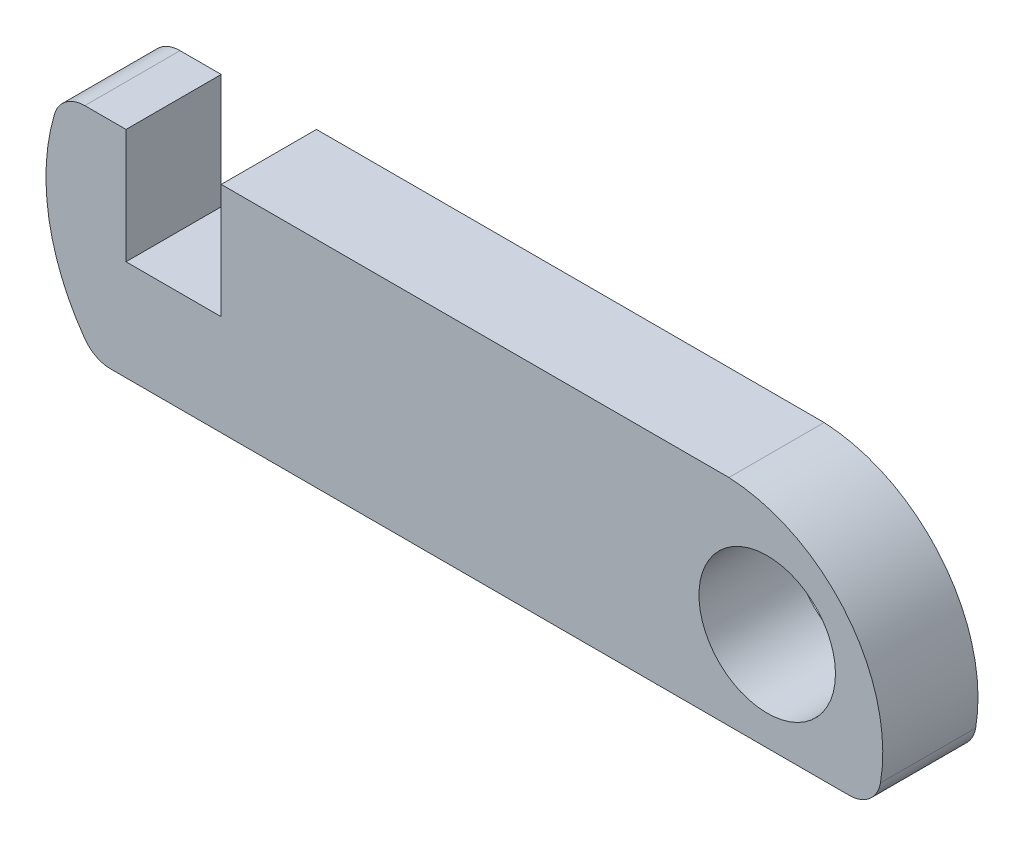
ISO-10303-21;
HEADER;
FILE_DESCRIPTION(('STEP AP214'),'2;1');
FILE_NAME('part.step','',(''),(''),'','','');
FILE_SCHEMA(('AUTOMOTIVE_DESIGN { 1 0 10303 214 1 1 1 1 }'));
ENDSEC;
DATA;
#1=APPLICATION_CONTEXT('core data for automotive mechanical design processes');
#2=APPLICATION_PROTOCOL_DEFINITION('international standard','automotive_design',2000,#1);
#3=PRODUCT_CONTEXT('',#1,'mechanical');
#4=PRODUCT('Part','Part','',(#3));
#5=PRODUCT_RELATED_PRODUCT_CATEGORY('part','',(#4));
#6=PRODUCT_DEFINITION_FORMATION('','',#4);
#7=PRODUCT_DEFINITION_CONTEXT('part definition',#1,'design');
#8=PRODUCT_DEFINITION('design','',#6,#7);
#9=PRODUCT_DEFINITION_SHAPE('','',#8);
#10=(LENGTH_UNIT() NAMED_UNIT(*) SI_UNIT(.MILLI.,.METRE.));
#11=(NAMED_UNIT(*) PLANE_ANGLE_UNIT() SI_UNIT($,.RADIAN.));
#12=(NAMED_UNIT(*) SI_UNIT($,.STERADIAN.) SOLID_ANGLE_UNIT());
#13=UNCERTAINTY_MEASURE_WITH_UNIT(LENGTH_MEASURE(1.E-05),#10,'distance_accuracy_value','');
#14=(GEOMETRIC_REPRESENTATION_CONTEXT(3) GLOBAL_UNCERTAINTY_ASSIGNED_CONTEXT((#13)) GLOBAL_UNIT_ASSIGNED_CONTEXT((#10,
#11,#12)) REPRESENTATION_CONTEXT('',''));
#15=CARTESIAN_POINT('',(0.,0.,0.));
#16=DIRECTION('',(0.,0.,1.));
#17=DIRECTION('',(1.,0.,0.));
#18=AXIS2_PLACEMENT_3D('',#15,#16,#17);
#19=CARTESIAN_POINT('',(24.7815778255979,-5.77777777777778,3.));
#20=DIRECTION('',(0.,0.,-1.));
#21=DIRECTION('',(-1.,0.,0.));
#22=AXIS2_PLACEMENT_3D('',#19,#20,#21);
#23=CYLINDRICAL_SURFACE('',#22,1.);
#24=CARTESIAN_POINT('',(24.7815778255979,-5.77777777777778,0.));
#25=DIRECTION('',(0.,0.,1.));
#26=DIRECTION('',(1.,0.,0.));
#27=AXIS2_PLACEMENT_3D('',#24,#25,#26);
#28=CIRCLE('',#27,1.);
#29=CARTESIAN_POINT('',(25.7671577611333,-5.94698826997632,0.));
#30=VERTEX_POINT('',#29);
#31=CARTESIAN_POINT('',(24.7815778255979,-6.77777777777778,0.));
#32=VERTEX_POINT('',#31);
#33=EDGE_CURVE('E151',#30,#32,#28,.F.);
#34=ORIENTED_EDGE('',*,*,#33,.F.);
#35=DIRECTION('',(0.,0.,-1.));
#36=VECTOR('',#35,1.);
#37=CARTESIAN_POINT('',(25.7671577611333,-5.94698826997632,3.));
#38=LINE('',#37,#36);
#39=CARTESIAN_POINT('',(25.7671577611333,-5.94698826997632,3.));
#40=VERTEX_POINT('',#39);
#41=EDGE_CURVE('E11',#40,#30,#38,.T.);
#42=ORIENTED_EDGE('',*,*,#41,.F.);
#43=CARTESIAN_POINT('',(24.7815778255979,-5.77777777777778,3.));
#44=DIRECTION('',(0.,0.,1.));
#45=DIRECTION('',(1.,0.,0.));
#46=AXIS2_PLACEMENT_3D('',#43,#44,#45);
#47=CIRCLE('',#46,1.);
#48=CARTESIAN_POINT('',(24.7815778255979,-6.77777777777778,3.));
#49=VERTEX_POINT('',#48);
#50=EDGE_CURVE('E182',#40,#49,#47,.F.);
#51=ORIENTED_EDGE('',*,*,#50,.T.);
#52=DIRECTION('',(0.,0.,-1.));
#53=VECTOR('',#52,1.);
#54=CARTESIAN_POINT('',(24.7815778255979,-6.77777777777778,3.));
#55=LINE('',#54,#53);
#56=EDGE_CURVE('E94',#49,#32,#55,.T.);
#57=ORIENTED_EDGE('',*,*,#56,.T.);
#58=EDGE_LOOP('',(#34,#42,#51,#57));
#59=FACE_BOUND('',#58,.T.);
#60=ADVANCED_FACE('F35',(#59),#23,.T.);
#61=CARTESIAN_POINT('',(20.7492357209889,-5.08548020998779,3.));
#62=DIRECTION('',(0.,0.,-1.));
#63=DIRECTION('',(-1.,0.,0.));
#64=AXIS2_PLACEMENT_3D('',#61,#62,#63);
#65=CYLINDRICAL_SURFACE('',#64,5.09133948371073);
#66=CARTESIAN_POINT('',(20.7492357209889,-5.08548020998779,0.));
#67=DIRECTION('',(0.,0.,1.));
#68=DIRECTION('',(1.,0.,0.));
#69=AXIS2_PLACEMENT_3D('',#66,#67,#68);
#70=CIRCLE('',#69,5.09133948371073);
#71=CARTESIAN_POINT('',(20.9934257539845,0.,0.));
#72=VERTEX_POINT('',#71);
#73=EDGE_CURVE('E154',#72,#30,#70,.F.);
#74=ORIENTED_EDGE('',*,*,#73,.F.);
#75=DIRECTION('',(0.,0.,-1.));
#76=VECTOR('',#75,1.);
#77=CARTESIAN_POINT('',(20.9934257539845,0.,3.));
#78=LINE('',#77,#76);
#79=CARTESIAN_POINT('',(20.9934257539845,0.,3.));
#80=VERTEX_POINT('',#79);
#81=EDGE_CURVE('E43',#80,#72,#78,.T.);
#82=ORIENTED_EDGE('',*,*,#81,.F.);
#83=CARTESIAN_POINT('',(20.7492357209889,-5.08548020998779,3.));
#84=DIRECTION('',(0.,0.,1.));
#85=DIRECTION('',(1.,0.,0.));
#86=AXIS2_PLACEMENT_3D('',#83,#84,#85);
#87=CIRCLE('',#86,5.09133948371073);
#88=EDGE_CURVE('E220',#80,#40,#87,.F.);
#89=ORIENTED_EDGE('',*,*,#88,.T.);
#90=ORIENTED_EDGE('',*,*,#41,.T.);
#91=EDGE_LOOP('',(#74,#82,#89,#90));
#92=FACE_BOUND('',#91,.T.);
#93=ADVANCED_FACE('F205',(#92),#65,.T.);
#94=CARTESIAN_POINT('',(0.,0.,3.));
#95=DIRECTION('',(0.,1.,0.));
#96=DIRECTION('',(0.,0.,1.));
#97=AXIS2_PLACEMENT_3D('',#94,#95,#96);
#98=PLANE('',#97);
#99=DIRECTION('',(1.,0.,0.));
#100=VECTOR('',#99,1.);
#101=CARTESIAN_POINT('',(0.,0.,0.));
#102=LINE('',#101,#100);
#103=CARTESIAN_POINT('',(5.,0.,0.));
#104=VERTEX_POINT('',#103);
#105=EDGE_CURVE('E157',#104,#72,#102,.T.);
#106=ORIENTED_EDGE('',*,*,#105,.F.);
#107=DIRECTION('',(0.,0.,-1.));
#108=VECTOR('',#107,1.);
#109=CARTESIAN_POINT('',(5.,0.,3.));
#110=LINE('',#109,#108);
#111=CARTESIAN_POINT('',(5.,0.,3.));
#112=VERTEX_POINT('',#111);
#113=EDGE_CURVE('E194',#112,#104,#110,.T.);
#114=ORIENTED_EDGE('',*,*,#113,.F.);
#115=DIRECTION('',(1.,0.,0.));
#116=VECTOR('',#115,1.);
#117=CARTESIAN_POINT('',(0.,0.,3.));
#118=LINE('',#117,#116);
#119=EDGE_CURVE('E201',#112,#80,#118,.T.);
#120=ORIENTED_EDGE('',*,*,#119,.T.);
#121=ORIENTED_EDGE('',*,*,#81,.T.);
#122=EDGE_LOOP('',(#106,#114,#120,#121));
#123=FACE_BOUND('',#122,.T.);
#124=ADVANCED_FACE('F199',(#123),#98,.T.);
#125=CARTESIAN_POINT('',(5.,0.,3.));
#126=DIRECTION('',(1.,0.,0.));
#127=DIRECTION('',(0.,0.,-1.));
#128=AXIS2_PLACEMENT_3D('',#125,#126,#127);
#129=PLANE('',#128);
#130=DIRECTION('',(0.,-1.,0.));
#131=VECTOR('',#130,1.);
#132=CARTESIAN_POINT('',(5.,0.,0.));
#133=LINE('',#132,#131);
#134=CARTESIAN_POINT('',(5.,-3.61111111111111,0.));
#135=VERTEX_POINT('',#134);
#136=EDGE_CURVE('E160',#104,#135,#133,.T.);
#137=ORIENTED_EDGE('',*,*,#136,.T.);
#138=DIRECTION('',(0.,0.,-1.));
#139=VECTOR('',#138,1.);
#140=CARTESIAN_POINT('',(5.,-3.61111111111111,3.));
#141=LINE('',#140,#139);
#142=CARTESIAN_POINT('',(5.,-3.61111111111111,3.));
#143=VERTEX_POINT('',#142);
#144=EDGE_CURVE('E192',#143,#135,#141,.T.);
#145=ORIENTED_EDGE('',*,*,#144,.F.);
#146=DIRECTION('',(0.,-1.,0.));
#147=VECTOR('',#146,1.);
#148=CARTESIAN_POINT('',(5.,0.,3.));
#149=LINE('',#148,#147);
#150=EDGE_CURVE('E216',#112,#143,#149,.T.);
#151=ORIENTED_EDGE('',*,*,#150,.F.);
#152=ORIENTED_EDGE('',*,*,#113,.T.);
#153=EDGE_LOOP('',(#137,#145,#151,#152));
#154=FACE_BOUND('',#153,.T.);
#155=ADVANCED_FACE('F213',(#154),#129,.F.);
#156=CARTESIAN_POINT('',(0.,-3.61111111111111,3.));
#157=DIRECTION('',(0.,1.,0.));
#158=DIRECTION('',(-1.,0.,0.));
#159=AXIS2_PLACEMENT_3D('',#156,#157,#158);
#160=PLANE('',#159);
#161=DIRECTION('',(1.,0.,0.));
#162=VECTOR('',#161,1.);
#163=CARTESIAN_POINT('',(0.,-3.61111111111111,0.));
#164=LINE('',#163,#162);
#165=CARTESIAN_POINT('',(2.,-3.61111111111111,0.));
#166=VERTEX_POINT('',#165);
#167=EDGE_CURVE('E163',#166,#135,#164,.T.);
#168=ORIENTED_EDGE('',*,*,#167,.F.);
#169=DIRECTION('',(0.,0.,-1.));
#170=VECTOR('',#169,1.);
#171=CARTESIAN_POINT('',(2.,-3.61111111111111,3.));
#172=LINE('',#171,#170);
#173=CARTESIAN_POINT('',(2.,-3.61111111111111,3.));
#174=VERTEX_POINT('',#173);
#175=EDGE_CURVE('E190',#174,#166,#172,.T.);
#176=ORIENTED_EDGE('',*,*,#175,.F.);
#177=DIRECTION('',(1.,0.,0.));
#178=VECTOR('',#177,1.);
#179=CARTESIAN_POINT('',(0.,-3.61111111111111,3.));
#180=LINE('',#179,#178);
#181=EDGE_CURVE('E218',#174,#143,#180,.T.);
#182=ORIENTED_EDGE('',*,*,#181,.T.);
#183=ORIENTED_EDGE('',*,*,#144,.T.);
#184=EDGE_LOOP('',(#168,#176,#182,#183));
#185=FACE_BOUND('',#184,.T.);
#186=ADVANCED_FACE('F320',(#185),#160,.T.);
#187=CARTESIAN_POINT('',(2.,0.,3.));
#188=DIRECTION('',(1.,0.,0.));
#189=DIRECTION('',(0.,1.,0.));
#190=AXIS2_PLACEMENT_3D('',#187,#188,#189);
#191=PLANE('',#190);
#192=DIRECTION('',(0.,-1.,0.));
#193=VECTOR('',#192,1.);
#194=CARTESIAN_POINT('',(2.,0.,0.));
#195=LINE('',#194,#193);
#196=CARTESIAN_POINT('',(2.,0.,0.));
#197=VERTEX_POINT('',#196);
#198=EDGE_CURVE('E166',#197,#166,#195,.T.);
#199=ORIENTED_EDGE('',*,*,#198,.F.);
#200=DIRECTION('',(0.,0.,-1.));
#201=VECTOR('',#200,1.);
#202=CARTESIAN_POINT('',(2.,0.,3.));
#203=LINE('',#202,#201);
#204=CARTESIAN_POINT('',(2.,0.,3.));
#205=VERTEX_POINT('',#204);
#206=EDGE_CURVE('E188',#205,#197,#203,.T.);
#207=ORIENTED_EDGE('',*,*,#206,.F.);
#208=DIRECTION('',(0.,-1.,0.));
#209=VECTOR('',#208,1.);
#210=CARTESIAN_POINT('',(2.,0.,3.));
#211=LINE('',#210,#209);
#212=EDGE_CURVE('E226',#205,#174,#211,.T.);
#213=ORIENTED_EDGE('',*,*,#212,.T.);
#214=ORIENTED_EDGE('',*,*,#175,.T.);
#215=EDGE_LOOP('',(#199,#207,#213,#214));
#216=FACE_BOUND('',#215,.T.);
#217=ADVANCED_FACE('F235',(#216),#191,.T.);
#218=CARTESIAN_POINT('',(0.,0.,3.));
#219=DIRECTION('',(0.,1.,0.));
#220=DIRECTION('',(0.,0.,1.));
#221=AXIS2_PLACEMENT_3D('',#218,#219,#220);
#222=PLANE('',#221);
#223=DIRECTION('',(1.,0.,0.));
#224=VECTOR('',#223,1.);
#225=CARTESIAN_POINT('',(0.,0.,0.));
#226=LINE('',#225,#224);
#227=CARTESIAN_POINT('',(0.702116043214498,0.,0.));
#228=VERTEX_POINT('',#227);
#229=EDGE_CURVE('E169',#228,#197,#226,.T.);
#230=ORIENTED_EDGE('',*,*,#229,.F.);
#231=DIRECTION('',(0.,0.,-1.));
#232=VECTOR('',#231,1.);
#233=CARTESIAN_POINT('',(0.702116043214498,0.,3.));
#234=LINE('',#233,#232);
#235=CARTESIAN_POINT('',(0.702116043214498,0.,3.));
#236=VERTEX_POINT('',#235);
#237=EDGE_CURVE('E186',#236,#228,#234,.T.);
#238=ORIENTED_EDGE('',*,*,#237,.F.);
#239=DIRECTION('',(1.,0.,0.));
#240=VECTOR('',#239,1.);
#241=CARTESIAN_POINT('',(0.,0.,3.));
#242=LINE('',#241,#240);
#243=EDGE_CURVE('E143',#236,#205,#242,.T.);
#244=ORIENTED_EDGE('',*,*,#243,.T.);
#245=ORIENTED_EDGE('',*,*,#206,.T.);
#246=EDGE_LOOP('',(#230,#238,#244,#245));
#247=FACE_BOUND('',#246,.T.);
#248=ADVANCED_FACE('F231',(#247),#222,.T.);
#249=CARTESIAN_POINT('',(0.702116043214498,-1.,3.));
#250=DIRECTION('',(0.,0.,-1.));
#251=DIRECTION('',(-1.,0.,0.));
#252=AXIS2_PLACEMENT_3D('',#249,#250,#251);
#253=CYLINDRICAL_SURFACE('',#252,1.);
#254=CARTESIAN_POINT('',(0.702116043214498,-1.,0.));
#255=DIRECTION('',(0.,0.,1.));
#256=DIRECTION('',(1.,0.,0.));
#257=AXIS2_PLACEMENT_3D('',#254,#255,#256);
#258=CIRCLE('',#257,1.);
#259=CARTESIAN_POINT('',(-0.257384218573151,-0.718292265584643,0.));
#260=VERTEX_POINT('',#259);
#261=EDGE_CURVE('E172',#228,#260,#258,.T.);
#262=ORIENTED_EDGE('',*,*,#261,.T.);
#263=DIRECTION('',(0.,0.,-1.));
#264=VECTOR('',#263,1.);
#265=CARTESIAN_POINT('',(-0.257384218573151,-0.718292265584643,3.));
#266=LINE('',#265,#264);
#267=CARTESIAN_POINT('',(-0.257384218573151,-0.718292265584643,3.));
#268=VERTEX_POINT('',#267);
#269=EDGE_CURVE('E130',#268,#260,#266,.T.);
#270=ORIENTED_EDGE('',*,*,#269,.F.);
#271=CARTESIAN_POINT('',(0.702116043214498,-1.,3.));
#272=DIRECTION('',(0.,0.,1.));
#273=DIRECTION('',(1.,0.,0.));
#274=AXIS2_PLACEMENT_3D('',#271,#272,#273);
#275=CIRCLE('',#274,1.);
#276=EDGE_CURVE('E140',#236,#268,#275,.T.);
#277=ORIENTED_EDGE('',*,*,#276,.F.);
#278=ORIENTED_EDGE('',*,*,#237,.T.);
#279=EDGE_LOOP('',(#262,#270,#277,#278));
#280=FACE_BOUND('',#279,.T.);
#281=ADVANCED_FACE('F238',(#280),#253,.T.);
#282=CARTESIAN_POINT('',(6.00343273768083,-2.55645805935896,3.));
#283=DIRECTION('',(0.,0.,-1.));
#284=DIRECTION('',(-1.,0.,0.));
#285=AXIS2_PLACEMENT_3D('',#282,#283,#284);
#286=CYLINDRICAL_SURFACE('',#285,6.52508102977422);
#287=CARTESIAN_POINT('',(6.00343273768083,-2.55645805935896,0.));
#288=DIRECTION('',(0.,0.,1.));
#289=DIRECTION('',(1.,0.,0.));
#290=AXIS2_PLACEMENT_3D('',#287,#288,#289);
#291=CIRCLE('',#290,6.52508102977422);
#292=CARTESIAN_POINT('',(0.702153460463403,-6.36081351988897,0.));
#293=VERTEX_POINT('',#292);
#294=EDGE_CURVE('E129',#293,#260,#291,.F.);
#295=ORIENTED_EDGE('',*,*,#294,.F.);
#296=DIRECTION('',(0.,0.,-1.));
#297=VECTOR('',#296,1.);
#298=CARTESIAN_POINT('',(0.702153460463403,-6.36081351988897,3.));
#299=LINE('',#298,#297);
#300=CARTESIAN_POINT('',(0.702153460463403,-6.36081351988897,3.));
#301=VERTEX_POINT('',#300);
#302=EDGE_CURVE('E123',#301,#293,#299,.T.);
#303=ORIENTED_EDGE('',*,*,#302,.F.);
#304=CARTESIAN_POINT('',(6.00343273768083,-2.55645805935896,3.));
#305=DIRECTION('',(0.,0.,1.));
#306=DIRECTION('',(1.,0.,0.));
#307=AXIS2_PLACEMENT_3D('',#304,#305,#306);
#308=CIRCLE('',#307,6.52508102977422);
#309=EDGE_CURVE('E127',#301,#268,#308,.F.);
#310=ORIENTED_EDGE('',*,*,#309,.T.);
#311=ORIENTED_EDGE('',*,*,#269,.T.);
#312=EDGE_LOOP('',(#295,#303,#310,#311));
#313=FACE_BOUND('',#312,.T.);
#314=ADVANCED_FACE('F125',(#313),#286,.T.);
#315=CARTESIAN_POINT('',(1.51459996542288,-5.77777777777778,3.));
#316=DIRECTION('',(0.,0.,-1.));
#317=DIRECTION('',(-1.,0.,0.));
#318=AXIS2_PLACEMENT_3D('',#315,#316,#317);
#319=CYLINDRICAL_SURFACE('',#318,1.);
#320=CARTESIAN_POINT('',(1.51459996542288,-5.77777777777778,0.));
#321=DIRECTION('',(0.,0.,1.));
#322=DIRECTION('',(1.,0.,0.));
#323=AXIS2_PLACEMENT_3D('',#320,#321,#322);
#324=CIRCLE('',#323,1.);
#325=CARTESIAN_POINT('',(1.51459996542288,-6.77777777777778,0.));
#326=VERTEX_POINT('',#325);
#327=EDGE_CURVE('E87',#293,#326,#324,.T.);
#328=ORIENTED_EDGE('',*,*,#327,.T.);
#329=DIRECTION('',(0.,0.,-1.));
#330=VECTOR('',#329,1.);
#331=CARTESIAN_POINT('',(1.51459996542288,-6.77777777777778,3.));
#332=LINE('',#331,#330);
#333=CARTESIAN_POINT('',(1.51459996542288,-6.77777777777778,3.));
#334=VERTEX_POINT('',#333);
#335=EDGE_CURVE('E131',#334,#326,#332,.T.);
#336=ORIENTED_EDGE('',*,*,#335,.F.);
#337=CARTESIAN_POINT('',(1.51459996542288,-5.77777777777778,3.));
#338=DIRECTION('',(0.,0.,1.));
#339=DIRECTION('',(1.,0.,0.));
#340=AXIS2_PLACEMENT_3D('',#337,#338,#339);
#341=CIRCLE('',#340,1.);
#342=EDGE_CURVE('E133',#301,#334,#341,.T.);
#343=ORIENTED_EDGE('',*,*,#342,.F.);
#344=ORIENTED_EDGE('',*,*,#302,.T.);
#345=EDGE_LOOP('',(#328,#336,#343,#344));
#346=FACE_BOUND('',#345,.T.);
#347=ADVANCED_FACE('F134',(#346),#319,.T.);
#348=CARTESIAN_POINT('',(0.,-6.77777777777778,3.));
#349=DIRECTION('',(0.,1.,0.));
#350=DIRECTION('',(-1.,0.,0.));
#351=AXIS2_PLACEMENT_3D('',#348,#349,#350);
#352=PLANE('',#351);
#353=DIRECTION('',(1.,0.,0.));
#354=VECTOR('',#353,1.);
#355=CARTESIAN_POINT('',(0.,-6.77777777777778,0.));
#356=LINE('',#355,#354);
#357=EDGE_CURVE('E177',#326,#32,#356,.T.);
#358=ORIENTED_EDGE('',*,*,#357,.T.);
#359=ORIENTED_EDGE('',*,*,#56,.F.);
#360=DIRECTION('',(1.,0.,0.));
#361=VECTOR('',#360,1.);
#362=CARTESIAN_POINT('',(0.,-6.77777777777778,3.));
#363=LINE('',#362,#361);
#364=EDGE_CURVE('E51',#334,#49,#363,.T.);
#365=ORIENTED_EDGE('',*,*,#364,.F.);
#366=ORIENTED_EDGE('',*,*,#335,.T.);
#367=EDGE_LOOP('',(#358,#359,#365,#366));
#368=FACE_BOUND('',#367,.T.);
#369=ADVANCED_FACE('F253',(#368),#352,.F.);
#370=CARTESIAN_POINT('',(22.2,-3.67777777777779,3.));
#371=DIRECTION('',(0.,0.,-1.));
#372=DIRECTION('',(-1.,0.,0.));
#373=AXIS2_PLACEMENT_3D('',#370,#371,#372);
#374=CYLINDRICAL_SURFACE('',#373,2.15);
#375=CARTESIAN_POINT('',(22.2,-3.67777777777779,3.));
#376=DIRECTION('',(0.,0.,1.));
#377=DIRECTION('',(1.,0.,0.));
#378=AXIS2_PLACEMENT_3D('',#375,#376,#377);
#379=CIRCLE('',#378,2.15);
#380=CARTESIAN_POINT('',(24.35,-3.67777777777779,3.));
#381=VERTEX_POINT('',#380);
#382=EDGE_CURVE('E148',#381,#381,#379,.T.);
#383=ORIENTED_EDGE('',*,*,#382,.T.);
#384=EDGE_LOOP('',(#383));
#385=FACE_BOUND('',#384,.T.);
#386=CARTESIAN_POINT('',(22.2,-3.67777777777779,0.));
#387=DIRECTION('',(0.,0.,1.));
#388=DIRECTION('',(1.,0.,0.));
#389=AXIS2_PLACEMENT_3D('',#386,#387,#388);
#390=CIRCLE('',#389,2.15);
#391=CARTESIAN_POINT('',(24.35,-3.67777777777779,0.));
#392=VERTEX_POINT('',#391);
#393=EDGE_CURVE('E179',#392,#392,#390,.T.);
#394=ORIENTED_EDGE('',*,*,#393,.F.);
#395=EDGE_LOOP('',(#394));
#396=FACE_BOUND('',#395,.T.);
#397=ADVANCED_FACE('F255',(#385,#396),#374,.F.);
#398=CARTESIAN_POINT('',(0.,0.,3.));
#399=DIRECTION('',(0.,0.,1.));
#400=DIRECTION('',(1.,0.,0.));
#401=AXIS2_PLACEMENT_3D('',#398,#399,#400);
#402=PLANE('',#401);
#403=ORIENTED_EDGE('',*,*,#50,.F.);
#404=ORIENTED_EDGE('',*,*,#88,.F.);
#405=ORIENTED_EDGE('',*,*,#119,.F.);
#406=ORIENTED_EDGE('',*,*,#150,.T.);
#407=ORIENTED_EDGE('',*,*,#181,.F.);
#408=ORIENTED_EDGE('',*,*,#212,.F.);
#409=ORIENTED_EDGE('',*,*,#243,.F.);
#410=ORIENTED_EDGE('',*,*,#276,.T.);
#411=ORIENTED_EDGE('',*,*,#309,.F.);
#412=ORIENTED_EDGE('',*,*,#342,.T.);
#413=ORIENTED_EDGE('',*,*,#364,.T.);
#414=EDGE_LOOP('',(#403,#404,#405,#406,#407,#408,#409,#410,#411,#412,#413));
#415=FACE_BOUND('',#414,.T.);
#416=ORIENTED_EDGE('',*,*,#382,.F.);
#417=EDGE_LOOP('',(#416));
#418=FACE_BOUND('',#417,.T.);
#419=ADVANCED_FACE('F136',(#415,#418),#402,.T.);
#420=CARTESIAN_POINT('',(0.,0.,0.));
#421=DIRECTION('',(0.,0.,1.));
#422=DIRECTION('',(1.,0.,0.));
#423=AXIS2_PLACEMENT_3D('',#420,#421,#422);
#424=PLANE('',#423);
#425=ORIENTED_EDGE('',*,*,#33,.T.);
#426=ORIENTED_EDGE('',*,*,#357,.F.);
#427=ORIENTED_EDGE('',*,*,#327,.F.);
#428=ORIENTED_EDGE('',*,*,#294,.T.);
#429=ORIENTED_EDGE('',*,*,#261,.F.);
#430=ORIENTED_EDGE('',*,*,#229,.T.);
#431=ORIENTED_EDGE('',*,*,#198,.T.);
#432=ORIENTED_EDGE('',*,*,#167,.T.);
#433=ORIENTED_EDGE('',*,*,#136,.F.);
#434=ORIENTED_EDGE('',*,*,#105,.T.);
#435=ORIENTED_EDGE('',*,*,#73,.T.);
#436=EDGE_LOOP('',(#425,#426,#427,#428,#429,#430,#431,#432,#433,#434,#435));
#437=FACE_BOUND('',#436,.T.);
#438=ORIENTED_EDGE('',*,*,#393,.T.);
#439=EDGE_LOOP('',(#438));
#440=FACE_BOUND('',#439,.T.);
#441=ADVANCED_FACE('F208',(#437,#440),#424,.F.);
#442=CLOSED_SHELL('',(#60,#93,#124,#155,#186,#217,#248,#281,#314,#347,#369,#397,#419,#441));
#443=MANIFOLD_SOLID_BREP('B2',#442);
#444=ADVANCED_BREP_SHAPE_REPRESENTATION('',(#18,#443),#14);
#445=SHAPE_DEFINITION_REPRESENTATION(#9,#444);
ENDSEC;
END-ISO-10303-21;
